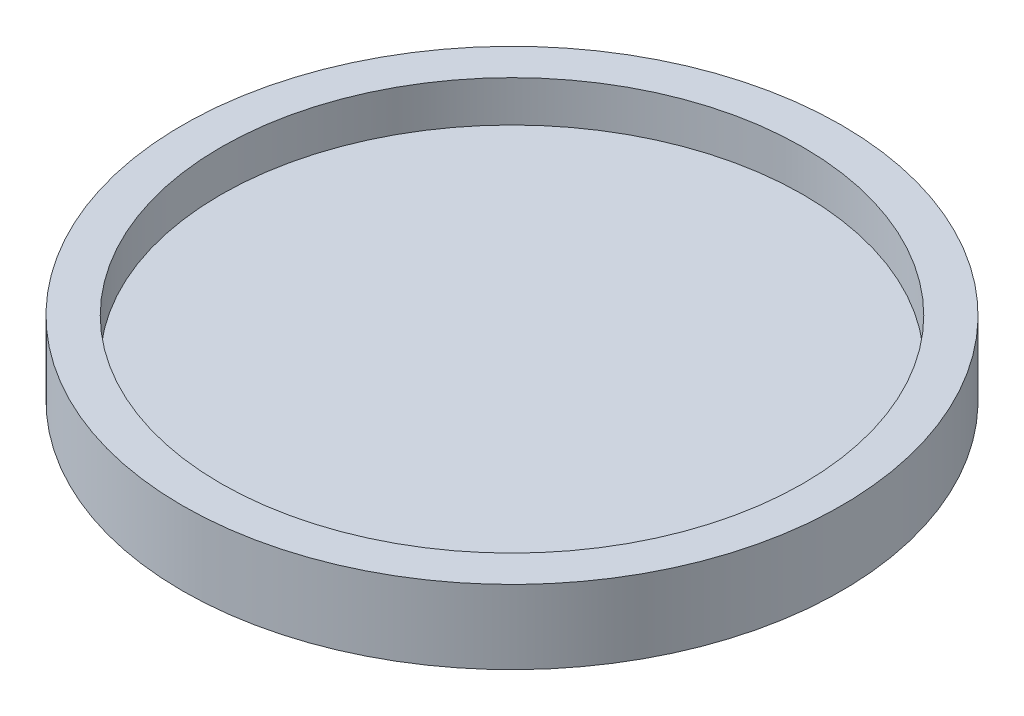
ISO-10303-21;
HEADER;
FILE_DESCRIPTION(('STEP AP214'),'2;1');
FILE_NAME('part.step','',(''),(''),'','','');
FILE_SCHEMA(('AUTOMOTIVE_DESIGN { 1 0 10303 214 1 1 1 1 }'));
ENDSEC;
DATA;
#1=APPLICATION_CONTEXT('core data for automotive mechanical design processes');
#2=APPLICATION_PROTOCOL_DEFINITION('international standard','automotive_design',2000,#1);
#3=PRODUCT_CONTEXT('',#1,'mechanical');
#4=PRODUCT('Part','Part','',(#3));
#5=PRODUCT_RELATED_PRODUCT_CATEGORY('part','',(#4));
#6=PRODUCT_DEFINITION_FORMATION('','',#4);
#7=PRODUCT_DEFINITION_CONTEXT('part definition',#1,'design');
#8=PRODUCT_DEFINITION('design','',#6,#7);
#9=PRODUCT_DEFINITION_SHAPE('','',#8);
#10=(LENGTH_UNIT() NAMED_UNIT(*) SI_UNIT(.MILLI.,.METRE.));
#11=(NAMED_UNIT(*) PLANE_ANGLE_UNIT() SI_UNIT($,.RADIAN.));
#12=(NAMED_UNIT(*) SI_UNIT($,.STERADIAN.) SOLID_ANGLE_UNIT());
#13=UNCERTAINTY_MEASURE_WITH_UNIT(LENGTH_MEASURE(1.E-05),#10,'distance_accuracy_value','');
#14=(GEOMETRIC_REPRESENTATION_CONTEXT(3) GLOBAL_UNCERTAINTY_ASSIGNED_CONTEXT((#13)) GLOBAL_UNIT_ASSIGNED_CONTEXT((#10,
#11,#12)) REPRESENTATION_CONTEXT('',''));
#15=CARTESIAN_POINT('',(0.,0.,0.));
#16=DIRECTION('',(0.,0.,1.));
#17=DIRECTION('',(1.,0.,0.));
#18=AXIS2_PLACEMENT_3D('',#15,#16,#17);
#19=CARTESIAN_POINT('',(0.,6.35,0.));
#20=DIRECTION('',(0.,1.,0.));
#21=DIRECTION('',(0.,0.,1.));
#22=AXIS2_PLACEMENT_3D('',#19,#20,#21);
#23=PLANE('',#22);
#24=CARTESIAN_POINT('',(0.,6.35,0.));
#25=DIRECTION('',(0.,1.,0.));
#26=DIRECTION('',(0.,0.,1.));
#27=AXIS2_PLACEMENT_3D('',#24,#25,#26);
#28=CIRCLE('',#27,51.0286);
#29=CARTESIAN_POINT('',(0.,6.35,51.0286));
#30=VERTEX_POINT('',#29);
#31=EDGE_CURVE('E10',#30,#30,#28,.T.);
#32=ORIENTED_EDGE('',*,*,#31,.T.);
#33=EDGE_LOOP('',(#32));
#34=FACE_BOUND('',#33,.T.);
#35=CARTESIAN_POINT('',(0.,6.35,0.));
#36=DIRECTION('',(0.,1.,0.));
#37=DIRECTION('',(0.,0.,1.));
#38=AXIS2_PLACEMENT_3D('',#35,#36,#37);
#39=CIRCLE('',#38,45.085);
#40=CARTESIAN_POINT('',(0.,6.35,45.085));
#41=VERTEX_POINT('',#40);
#42=EDGE_CURVE('E37',#41,#41,#39,.T.);
#43=ORIENTED_EDGE('',*,*,#42,.F.);
#44=EDGE_LOOP('',(#43));
#45=FACE_BOUND('',#44,.T.);
#46=ADVANCED_FACE('F30',(#34,#45),#23,.T.);
#47=CARTESIAN_POINT('',(0.,6.35,0.));
#48=DIRECTION('',(0.,-1.,0.));
#49=DIRECTION('',(0.,0.,-1.));
#50=AXIS2_PLACEMENT_3D('',#47,#48,#49);
#51=CYLINDRICAL_SURFACE('',#50,51.0286);
#52=ORIENTED_EDGE('',*,*,#31,.F.);
#53=EDGE_LOOP('',(#52));
#54=FACE_BOUND('',#53,.T.);
#55=CARTESIAN_POINT('',(0.,-5.08,0.));
#56=DIRECTION('',(0.,-1.,0.));
#57=DIRECTION('',(0.,0.,-1.));
#58=AXIS2_PLACEMENT_3D('',#55,#56,#57);
#59=CIRCLE('',#58,51.0286);
#60=CARTESIAN_POINT('',(0.,-5.08,-51.0286));
#61=VERTEX_POINT('',#60);
#62=EDGE_CURVE('E46',#61,#61,#59,.T.);
#63=ORIENTED_EDGE('',*,*,#62,.F.);
#64=EDGE_LOOP('',(#63));
#65=FACE_BOUND('',#64,.T.);
#66=ADVANCED_FACE('F32',(#54,#65),#51,.T.);
#67=CARTESIAN_POINT('',(0.,6.35,0.));
#68=DIRECTION('',(0.,-1.,0.));
#69=DIRECTION('',(0.,0.,-1.));
#70=AXIS2_PLACEMENT_3D('',#67,#68,#69);
#71=CYLINDRICAL_SURFACE('',#70,45.085);
#72=ORIENTED_EDGE('',*,*,#42,.T.);
#73=EDGE_LOOP('',(#72));
#74=FACE_BOUND('',#73,.T.);
#75=CARTESIAN_POINT('',(0.,0.,0.));
#76=DIRECTION('',(0.,1.,0.));
#77=DIRECTION('',(0.,0.,1.));
#78=AXIS2_PLACEMENT_3D('',#75,#76,#77);
#79=CIRCLE('',#78,45.085);
#80=CARTESIAN_POINT('',(0.,0.,45.085));
#81=VERTEX_POINT('',#80);
#82=EDGE_CURVE('E41',#81,#81,#79,.T.);
#83=ORIENTED_EDGE('',*,*,#82,.F.);
#84=EDGE_LOOP('',(#83));
#85=FACE_BOUND('',#84,.T.);
#86=ADVANCED_FACE('F54',(#74,#85),#71,.F.);
#87=CARTESIAN_POINT('',(0.,0.,0.));
#88=DIRECTION('',(0.,-1.,0.));
#89=DIRECTION('',(0.,0.,-1.));
#90=AXIS2_PLACEMENT_3D('',#87,#88,#89);
#91=PLANE('',#90);
#92=ORIENTED_EDGE('',*,*,#82,.T.);
#93=EDGE_LOOP('',(#92));
#94=FACE_BOUND('',#93,.T.);
#95=ADVANCED_FACE('F60',(#94),#91,.F.);
#96=CARTESIAN_POINT('',(0.,-5.08,0.));
#97=DIRECTION('',(0.,-1.,0.));
#98=DIRECTION('',(0.,0.,-1.));
#99=AXIS2_PLACEMENT_3D('',#96,#97,#98);
#100=PLANE('',#99);
#101=ORIENTED_EDGE('',*,*,#62,.T.);
#102=EDGE_LOOP('',(#101));
#103=FACE_BOUND('',#102,.T.);
#104=ADVANCED_FACE('F51',(#103),#100,.T.);
#105=CLOSED_SHELL('',(#46,#66,#86,#95,#104));
#106=MANIFOLD_SOLID_BREP('B2',#105);
#107=ADVANCED_BREP_SHAPE_REPRESENTATION('',(#18,#106),#14);
#108=SHAPE_DEFINITION_REPRESENTATION(#9,#107);
ENDSEC;
END-ISO-10303-21;
